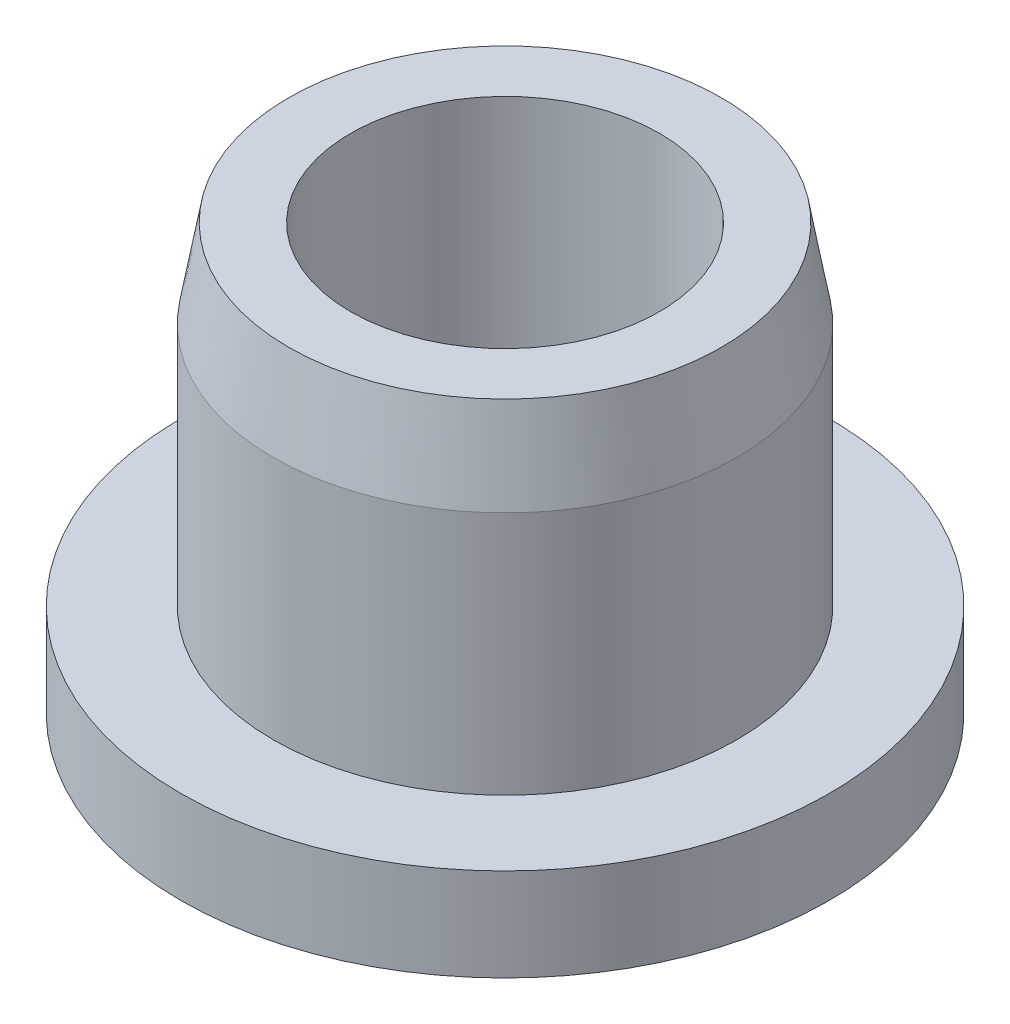
ISO-10303-21;
HEADER;
FILE_DESCRIPTION(('STEP AP214'),'2;1');
FILE_NAME('part.step','',(''),(''),'','','');
FILE_SCHEMA(('AUTOMOTIVE_DESIGN { 1 0 10303 214 1 1 1 1 }'));
ENDSEC;
DATA;
#1=APPLICATION_CONTEXT('core data for automotive mechanical design processes');
#2=APPLICATION_PROTOCOL_DEFINITION('international standard','automotive_design',2000,#1);
#3=PRODUCT_CONTEXT('',#1,'mechanical');
#4=PRODUCT('Part','Part','',(#3));
#5=PRODUCT_RELATED_PRODUCT_CATEGORY('part','',(#4));
#6=PRODUCT_DEFINITION_FORMATION('','',#4);
#7=PRODUCT_DEFINITION_CONTEXT('part definition',#1,'design');
#8=PRODUCT_DEFINITION('design','',#6,#7);
#9=PRODUCT_DEFINITION_SHAPE('','',#8);
#10=(LENGTH_UNIT() NAMED_UNIT(*) SI_UNIT(.MILLI.,.METRE.));
#11=(NAMED_UNIT(*) PLANE_ANGLE_UNIT() SI_UNIT($,.RADIAN.));
#12=(NAMED_UNIT(*) SI_UNIT($,.STERADIAN.) SOLID_ANGLE_UNIT());
#13=UNCERTAINTY_MEASURE_WITH_UNIT(LENGTH_MEASURE(1.E-05),#10,'distance_accuracy_value','');
#14=(GEOMETRIC_REPRESENTATION_CONTEXT(3) GLOBAL_UNCERTAINTY_ASSIGNED_CONTEXT((#13)) GLOBAL_UNIT_ASSIGNED_CONTEXT((#10,
#11,#12)) REPRESENTATION_CONTEXT('',''));
#15=CARTESIAN_POINT('',(0.,0.,0.));
#16=DIRECTION('',(0.,0.,1.));
#17=DIRECTION('',(1.,0.,0.));
#18=AXIS2_PLACEMENT_3D('',#15,#16,#17);
#19=CARTESIAN_POINT('',(0.,5.5,0.));
#20=DIRECTION('',(0.,-1.,0.));
#21=DIRECTION('',(0.,0.,-1.));
#22=AXIS2_PLACEMENT_3D('',#19,#20,#21);
#23=CYLINDRICAL_SURFACE('',#22,3.);
#24=CARTESIAN_POINT('',(0.,1.2,0.));
#25=DIRECTION('',(0.,1.,0.));
#26=DIRECTION('',(0.,0.,1.));
#27=AXIS2_PLACEMENT_3D('',#24,#25,#26);
#28=CIRCLE('',#27,3.);
#29=CARTESIAN_POINT('',(0.,1.2,3.));
#30=VERTEX_POINT('',#29);
#31=EDGE_CURVE('E11',#30,#30,#28,.T.);
#32=ORIENTED_EDGE('',*,*,#31,.T.);
#33=EDGE_LOOP('',(#32));
#34=FACE_BOUND('',#33,.T.);
#35=CARTESIAN_POINT('',(0.,4.36574363607646,0.));
#36=DIRECTION('',(0.,-1.,0.));
#37=DIRECTION('',(0.,0.,-1.));
#38=AXIS2_PLACEMENT_3D('',#35,#36,#37);
#39=CIRCLE('',#38,3.);
#40=CARTESIAN_POINT('',(0.,4.36574363607646,-3.));
#41=VERTEX_POINT('',#40);
#42=EDGE_CURVE('E57',#41,#41,#39,.F.);
#43=ORIENTED_EDGE('',*,*,#42,.F.);
#44=EDGE_LOOP('',(#43));
#45=FACE_BOUND('',#44,.T.);
#46=ADVANCED_FACE('F41',(#34,#45),#23,.T.);
#47=CARTESIAN_POINT('',(0.,1.2,0.));
#48=DIRECTION('',(0.,-1.,0.));
#49=DIRECTION('',(0.,0.,-1.));
#50=AXIS2_PLACEMENT_3D('',#47,#48,#49);
#51=CYLINDRICAL_SURFACE('',#50,4.2);
#52=CARTESIAN_POINT('',(0.,1.2,0.));
#53=DIRECTION('',(0.,1.,0.));
#54=DIRECTION('',(0.,0.,1.));
#55=AXIS2_PLACEMENT_3D('',#52,#53,#54);
#56=CIRCLE('',#55,4.2);
#57=CARTESIAN_POINT('',(0.,1.2,4.2));
#58=VERTEX_POINT('',#57);
#59=EDGE_CURVE('E50',#58,#58,#56,.T.);
#60=ORIENTED_EDGE('',*,*,#59,.F.);
#61=EDGE_LOOP('',(#60));
#62=FACE_BOUND('',#61,.T.);
#63=CARTESIAN_POINT('',(0.,0.,0.));
#64=DIRECTION('',(0.,1.,0.));
#65=DIRECTION('',(0.,0.,1.));
#66=AXIS2_PLACEMENT_3D('',#63,#64,#65);
#67=CIRCLE('',#66,4.2);
#68=CARTESIAN_POINT('',(0.,0.,4.2));
#69=VERTEX_POINT('',#68);
#70=EDGE_CURVE('E45',#69,#69,#67,.T.);
#71=ORIENTED_EDGE('',*,*,#70,.T.);
#72=EDGE_LOOP('',(#71));
#73=FACE_BOUND('',#72,.T.);
#74=ADVANCED_FACE('F43',(#62,#73),#51,.T.);
#75=CARTESIAN_POINT('',(0.,1.2,0.));
#76=DIRECTION('',(0.,1.,0.));
#77=DIRECTION('',(0.,0.,1.));
#78=AXIS2_PLACEMENT_3D('',#75,#76,#77);
#79=PLANE('',#78);
#80=ORIENTED_EDGE('',*,*,#59,.T.);
#81=EDGE_LOOP('',(#80));
#82=FACE_BOUND('',#81,.T.);
#83=ORIENTED_EDGE('',*,*,#31,.F.);
#84=EDGE_LOOP('',(#83));
#85=FACE_BOUND('',#84,.T.);
#86=ADVANCED_FACE('F100',(#82,#85),#79,.T.);
#87=CARTESIAN_POINT('',(0.,0.,0.));
#88=DIRECTION('',(0.,1.,0.));
#89=DIRECTION('',(0.,0.,1.));
#90=AXIS2_PLACEMENT_3D('',#87,#88,#89);
#91=PLANE('',#90);
#92=CARTESIAN_POINT('',(0.,0.,0.));
#93=DIRECTION('',(0.,1.,0.));
#94=DIRECTION('',(0.,0.,1.));
#95=AXIS2_PLACEMENT_3D('',#92,#93,#94);
#96=CIRCLE('',#95,2.);
#97=CARTESIAN_POINT('',(0.,0.,2.));
#98=VERTEX_POINT('',#97);
#99=EDGE_CURVE('E65',#98,#98,#96,.T.);
#100=ORIENTED_EDGE('',*,*,#99,.T.);
#101=EDGE_LOOP('',(#100));
#102=FACE_BOUND('',#101,.T.);
#103=ORIENTED_EDGE('',*,*,#70,.F.);
#104=EDGE_LOOP('',(#103));
#105=FACE_BOUND('',#104,.T.);
#106=ADVANCED_FACE('F74',(#102,#105),#91,.F.);
#107=CARTESIAN_POINT('',(0.,5.5,0.));
#108=DIRECTION('',(0.,-1.,0.));
#109=DIRECTION('',(0.,0.,1.));
#110=AXIS2_PLACEMENT_3D('',#107,#108,#109);
#111=CONICAL_SURFACE('',#110,2.8,0.174532925199433);
#112=CARTESIAN_POINT('',(0.,5.5,0.));
#113=DIRECTION('',(0.,1.,0.));
#114=DIRECTION('',(0.,0.,1.));
#115=AXIS2_PLACEMENT_3D('',#112,#113,#114);
#116=CIRCLE('',#115,2.8);
#117=CARTESIAN_POINT('',(0.,5.5,2.8));
#118=VERTEX_POINT('',#117);
#119=EDGE_CURVE('E61',#118,#118,#116,.T.);
#120=ORIENTED_EDGE('',*,*,#119,.F.);
#121=EDGE_LOOP('',(#120));
#122=FACE_BOUND('',#121,.T.);
#123=ORIENTED_EDGE('',*,*,#42,.T.);
#124=EDGE_LOOP('',(#123));
#125=FACE_BOUND('',#124,.T.);
#126=ADVANCED_FACE('F86',(#122,#125),#111,.T.);
#127=CARTESIAN_POINT('',(0.,5.5,0.));
#128=DIRECTION('',(0.,1.,0.));
#129=DIRECTION('',(0.,0.,1.));
#130=AXIS2_PLACEMENT_3D('',#127,#128,#129);
#131=PLANE('',#130);
#132=CARTESIAN_POINT('',(0.,5.5,0.));
#133=DIRECTION('',(0.,1.,0.));
#134=DIRECTION('',(0.,0.,1.));
#135=AXIS2_PLACEMENT_3D('',#132,#133,#134);
#136=CIRCLE('',#135,2.);
#137=CARTESIAN_POINT('',(0.,5.5,2.));
#138=VERTEX_POINT('',#137);
#139=EDGE_CURVE('E66',#138,#138,#136,.T.);
#140=ORIENTED_EDGE('',*,*,#139,.F.);
#141=EDGE_LOOP('',(#140));
#142=FACE_BOUND('',#141,.T.);
#143=ORIENTED_EDGE('',*,*,#119,.T.);
#144=EDGE_LOOP('',(#143));
#145=FACE_BOUND('',#144,.T.);
#146=ADVANCED_FACE('F80',(#142,#145),#131,.T.);
#147=CARTESIAN_POINT('',(0.,0.,0.));
#148=DIRECTION('',(0.,1.,0.));
#149=DIRECTION('',(0.,0.,1.));
#150=AXIS2_PLACEMENT_3D('',#147,#148,#149);
#151=CYLINDRICAL_SURFACE('',#150,2.);
#152=ORIENTED_EDGE('',*,*,#99,.F.);
#153=EDGE_LOOP('',(#152));
#154=FACE_BOUND('',#153,.T.);
#155=ORIENTED_EDGE('',*,*,#139,.T.);
#156=EDGE_LOOP('',(#155));
#157=FACE_BOUND('',#156,.T.);
#158=ADVANCED_FACE('F77',(#154,#157),#151,.F.);
#159=CLOSED_SHELL('',(#46,#74,#86,#106,#126,#146,#158));
#160=MANIFOLD_SOLID_BREP('B2',#159);
#161=ADVANCED_BREP_SHAPE_REPRESENTATION('',(#18,#160),#14);
#162=SHAPE_DEFINITION_REPRESENTATION(#9,#161);
ENDSEC;
END-ISO-10303-21;
